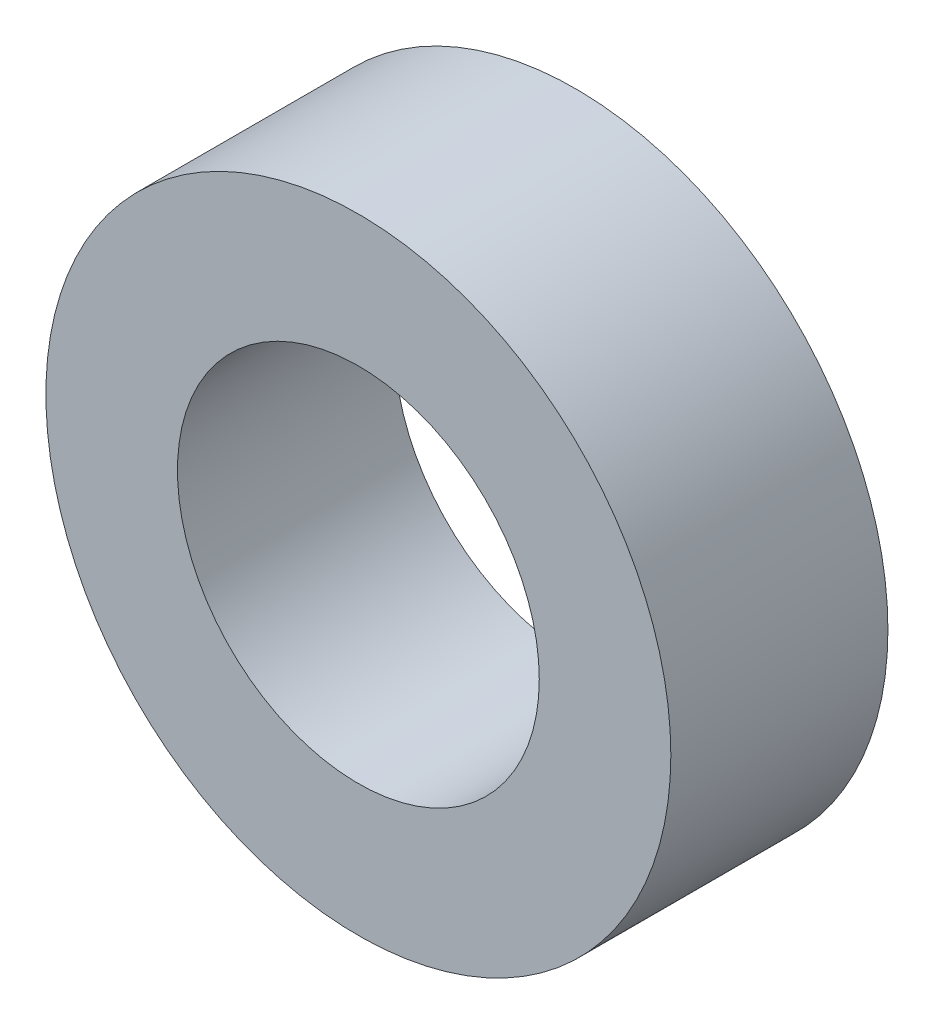
ISO-10303-21;
HEADER;
FILE_DESCRIPTION(('STEP AP214'),'2;1');
FILE_NAME('part.step','',(''),(''),'','','');
FILE_SCHEMA(('AUTOMOTIVE_DESIGN { 1 0 10303 214 1 1 1 1 }'));
ENDSEC;
DATA;
#1=APPLICATION_CONTEXT('core data for automotive mechanical design processes');
#2=APPLICATION_PROTOCOL_DEFINITION('international standard','automotive_design',2000,#1);
#3=PRODUCT_CONTEXT('',#1,'mechanical');
#4=PRODUCT('Part','Part','',(#3));
#5=PRODUCT_RELATED_PRODUCT_CATEGORY('part','',(#4));
#6=PRODUCT_DEFINITION_FORMATION('','',#4);
#7=PRODUCT_DEFINITION_CONTEXT('part definition',#1,'design');
#8=PRODUCT_DEFINITION('design','',#6,#7);
#9=PRODUCT_DEFINITION_SHAPE('','',#8);
#10=(LENGTH_UNIT() NAMED_UNIT(*) SI_UNIT(.MILLI.,.METRE.));
#11=(NAMED_UNIT(*) PLANE_ANGLE_UNIT() SI_UNIT($,.RADIAN.));
#12=(NAMED_UNIT(*) SI_UNIT($,.STERADIAN.) SOLID_ANGLE_UNIT());
#13=UNCERTAINTY_MEASURE_WITH_UNIT(LENGTH_MEASURE(1.E-05),#10,'distance_accuracy_value','');
#14=(GEOMETRIC_REPRESENTATION_CONTEXT(3) GLOBAL_UNCERTAINTY_ASSIGNED_CONTEXT((#13)) GLOBAL_UNIT_ASSIGNED_CONTEXT((#10,
#11,#12)) REPRESENTATION_CONTEXT('',''));
#15=CARTESIAN_POINT('',(0.,0.,0.));
#16=DIRECTION('',(0.,0.,1.));
#17=DIRECTION('',(1.,0.,0.));
#18=AXIS2_PLACEMENT_3D('',#15,#16,#17);
#19=CARTESIAN_POINT('',(0.,0.,3.3));
#20=DIRECTION('',(0.,0.,1.));
#21=DIRECTION('',(1.,0.,0.));
#22=AXIS2_PLACEMENT_3D('',#19,#20,#21);
#23=PLANE('',#22);
#24=CARTESIAN_POINT('',(0.,0.,3.3));
#25=DIRECTION('',(0.,0.,1.));
#26=DIRECTION('',(1.,0.,0.));
#27=AXIS2_PLACEMENT_3D('',#24,#25,#26);
#28=CIRCLE('',#27,4.75);
#29=CARTESIAN_POINT('',(4.75,0.,3.3));
#30=VERTEX_POINT('',#29);
#31=EDGE_CURVE('E10',#30,#30,#28,.T.);
#32=ORIENTED_EDGE('',*,*,#31,.T.);
#33=EDGE_LOOP('',(#32));
#34=FACE_BOUND('',#33,.T.);
#35=CARTESIAN_POINT('',(0.,0.,3.3));
#36=DIRECTION('',(0.,0.,1.));
#37=DIRECTION('',(1.,0.,0.));
#38=AXIS2_PLACEMENT_3D('',#35,#36,#37);
#39=CIRCLE('',#38,2.75);
#40=CARTESIAN_POINT('',(2.75,0.,3.3));
#41=VERTEX_POINT('',#40);
#42=EDGE_CURVE('E54',#41,#41,#39,.T.);
#43=ORIENTED_EDGE('',*,*,#42,.F.);
#44=EDGE_LOOP('',(#43));
#45=FACE_BOUND('',#44,.T.);
#46=ADVANCED_FACE('F41',(#34,#45),#23,.T.);
#47=CARTESIAN_POINT('',(0.,0.,0.));
#48=DIRECTION('',(0.,0.,1.));
#49=DIRECTION('',(1.,0.,0.));
#50=AXIS2_PLACEMENT_3D('',#47,#48,#49);
#51=PLANE('',#50);
#52=CARTESIAN_POINT('',(0.,0.,0.));
#53=DIRECTION('',(0.,0.,1.));
#54=DIRECTION('',(1.,0.,0.));
#55=AXIS2_PLACEMENT_3D('',#52,#53,#54);
#56=CIRCLE('',#55,4.75);
#57=CARTESIAN_POINT('',(4.75,0.,0.));
#58=VERTEX_POINT('',#57);
#59=EDGE_CURVE('E45',#58,#58,#56,.T.);
#60=ORIENTED_EDGE('',*,*,#59,.F.);
#61=EDGE_LOOP('',(#60));
#62=FACE_BOUND('',#61,.T.);
#63=CARTESIAN_POINT('',(0.,0.,0.));
#64=DIRECTION('',(0.,0.,1.));
#65=DIRECTION('',(1.,0.,0.));
#66=AXIS2_PLACEMENT_3D('',#63,#64,#65);
#67=CIRCLE('',#66,2.75);
#68=CARTESIAN_POINT('',(2.75,0.,0.));
#69=VERTEX_POINT('',#68);
#70=EDGE_CURVE('E56',#69,#69,#67,.T.);
#71=ORIENTED_EDGE('',*,*,#70,.T.);
#72=EDGE_LOOP('',(#71));
#73=FACE_BOUND('',#72,.T.);
#74=ADVANCED_FACE('F68',(#62,#73),#51,.F.);
#75=CARTESIAN_POINT('',(0.,0.,3.3));
#76=DIRECTION('',(0.,0.,-1.));
#77=DIRECTION('',(-1.,0.,0.));
#78=AXIS2_PLACEMENT_3D('',#75,#76,#77);
#79=CYLINDRICAL_SURFACE('',#78,4.75);
#80=ORIENTED_EDGE('',*,*,#31,.F.);
#81=EDGE_LOOP('',(#80));
#82=FACE_BOUND('',#81,.T.);
#83=ORIENTED_EDGE('',*,*,#59,.T.);
#84=EDGE_LOOP('',(#83));
#85=FACE_BOUND('',#84,.T.);
#86=ADVANCED_FACE('F43',(#82,#85),#79,.T.);
#87=CARTESIAN_POINT('',(0.,0.,3.3));
#88=DIRECTION('',(0.,0.,-1.));
#89=DIRECTION('',(-1.,0.,0.));
#90=AXIS2_PLACEMENT_3D('',#87,#88,#89);
#91=CYLINDRICAL_SURFACE('',#90,2.75);
#92=ORIENTED_EDGE('',*,*,#42,.T.);
#93=EDGE_LOOP('',(#92));
#94=FACE_BOUND('',#93,.T.);
#95=ORIENTED_EDGE('',*,*,#70,.F.);
#96=EDGE_LOOP('',(#95));
#97=FACE_BOUND('',#96,.T.);
#98=ADVANCED_FACE('F64',(#94,#97),#91,.F.);
#99=CLOSED_SHELL('',(#46,#74,#86,#98));
#100=MANIFOLD_SOLID_BREP('B2',#99);
#101=ADVANCED_BREP_SHAPE_REPRESENTATION('',(#18,#100),#14);
#102=SHAPE_DEFINITION_REPRESENTATION(#9,#101);
ENDSEC;
END-ISO-10303-21;
